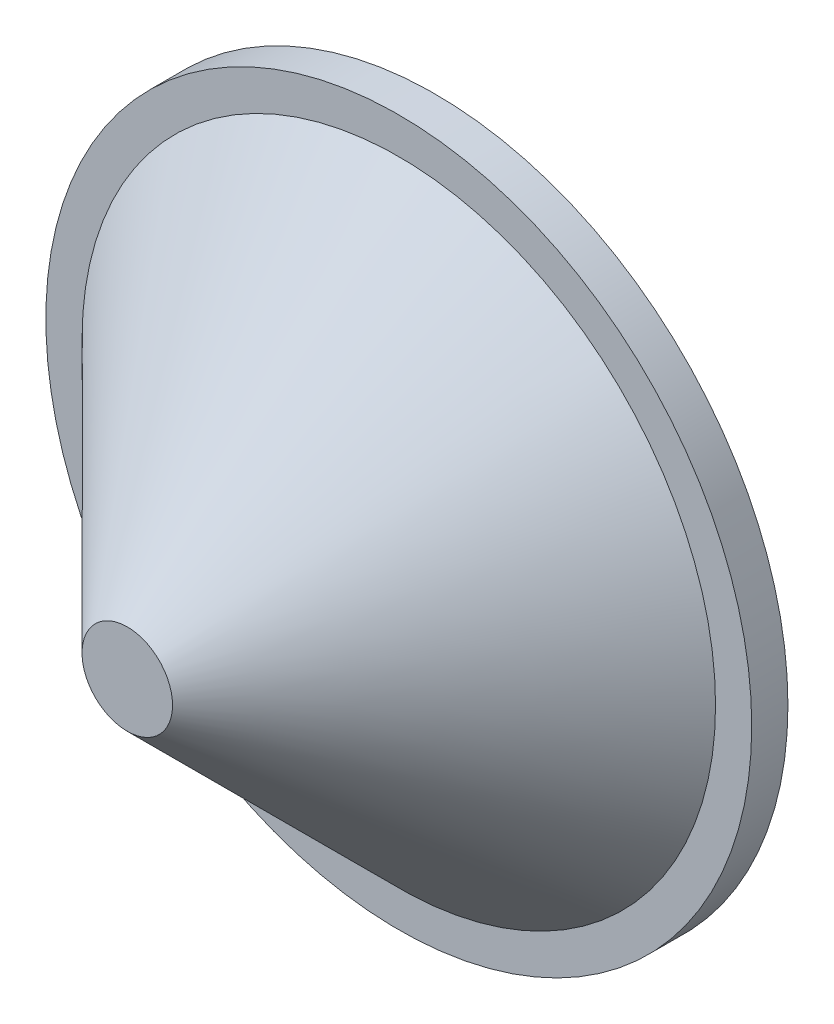
ISO-10303-21;
HEADER;
FILE_DESCRIPTION(('STEP AP214'),'2;1');
FILE_NAME('part.step','',(''),(''),'','','');
FILE_SCHEMA(('AUTOMOTIVE_DESIGN { 1 0 10303 214 1 1 1 1 }'));
ENDSEC;
DATA;
#1=APPLICATION_CONTEXT('core data for automotive mechanical design processes');
#2=APPLICATION_PROTOCOL_DEFINITION('international standard','automotive_design',2000,#1);
#3=PRODUCT_CONTEXT('',#1,'mechanical');
#4=PRODUCT('Part','Part','',(#3));
#5=PRODUCT_RELATED_PRODUCT_CATEGORY('part','',(#4));
#6=PRODUCT_DEFINITION_FORMATION('','',#4);
#7=PRODUCT_DEFINITION_CONTEXT('part definition',#1,'design');
#8=PRODUCT_DEFINITION('design','',#6,#7);
#9=PRODUCT_DEFINITION_SHAPE('','',#8);
#10=(LENGTH_UNIT() NAMED_UNIT(*) SI_UNIT(.MILLI.,.METRE.));
#11=(NAMED_UNIT(*) PLANE_ANGLE_UNIT() SI_UNIT($,.RADIAN.));
#12=(NAMED_UNIT(*) SI_UNIT($,.STERADIAN.) SOLID_ANGLE_UNIT());
#13=UNCERTAINTY_MEASURE_WITH_UNIT(LENGTH_MEASURE(1.E-05),#10,'distance_accuracy_value','');
#14=(GEOMETRIC_REPRESENTATION_CONTEXT(3) GLOBAL_UNCERTAINTY_ASSIGNED_CONTEXT((#13)) GLOBAL_UNIT_ASSIGNED_CONTEXT((#10,
#11,#12)) REPRESENTATION_CONTEXT('',''));
#15=CARTESIAN_POINT('',(0.,0.,0.));
#16=DIRECTION('',(0.,0.,1.));
#17=DIRECTION('',(1.,0.,0.));
#18=AXIS2_PLACEMENT_3D('',#15,#16,#17);
#19=CARTESIAN_POINT('',(0.,0.,0.));
#20=DIRECTION('',(0.,0.,1.));
#21=DIRECTION('',(1.,0.,0.));
#22=AXIS2_PLACEMENT_3D('',#19,#20,#21);
#23=PLANE('',#22);
#24=CARTESIAN_POINT('',(0.,0.,0.));
#25=DIRECTION('',(0.,0.,1.));
#26=DIRECTION('',(1.,0.,0.));
#27=AXIS2_PLACEMENT_3D('',#24,#25,#26);
#28=CIRCLE('',#27,38.9999999999995);
#29=CARTESIAN_POINT('',(38.9999999999996,0.,0.));
#30=VERTEX_POINT('',#29);
#31=EDGE_CURVE('E11',#30,#30,#28,.T.);
#32=ORIENTED_EDGE('',*,*,#31,.F.);
#33=EDGE_LOOP('',(#32));
#34=FACE_BOUND('',#33,.T.);
#35=DIRECTION('',(-0.707106781186548,0.707106781186547,0.));
#36=VECTOR('',#35,1.);
#37=CARTESIAN_POINT('',(-12.5,-15.5,0.));
#38=LINE('',#37,#36);
#39=CARTESIAN_POINT('',(-12.5,-15.5,0.));
#40=VERTEX_POINT('',#39);
#41=CARTESIAN_POINT('',(-15.5,-12.5,0.));
#42=VERTEX_POINT('',#41);
#43=EDGE_CURVE('E46',#40,#42,#38,.T.);
#44=ORIENTED_EDGE('',*,*,#43,.F.);
#45=DIRECTION('',(-1.,0.,0.));
#46=VECTOR('',#45,1.);
#47=CARTESIAN_POINT('',(-12.5,-15.5,0.));
#48=LINE('',#47,#46);
#49=CARTESIAN_POINT('',(12.5,-15.5,0.));
#50=VERTEX_POINT('',#49);
#51=EDGE_CURVE('E50',#50,#40,#48,.T.);
#52=ORIENTED_EDGE('',*,*,#51,.F.);
#53=DIRECTION('',(-0.707106781186548,-0.707106781186547,0.));
#54=VECTOR('',#53,1.);
#55=CARTESIAN_POINT('',(15.5,-12.5,0.));
#56=LINE('',#55,#54);
#57=CARTESIAN_POINT('',(15.5,-12.5,0.));
#58=VERTEX_POINT('',#57);
#59=EDGE_CURVE('E238',#58,#50,#56,.T.);
#60=ORIENTED_EDGE('',*,*,#59,.F.);
#61=DIRECTION('',(0.,-1.,0.));
#62=VECTOR('',#61,1.);
#63=CARTESIAN_POINT('',(15.5,-12.5,0.));
#64=LINE('',#63,#62);
#65=CARTESIAN_POINT('',(15.5,12.5,0.));
#66=VERTEX_POINT('',#65);
#67=EDGE_CURVE('E272',#66,#58,#64,.T.);
#68=ORIENTED_EDGE('',*,*,#67,.F.);
#69=DIRECTION('',(0.707106781186548,-0.707106781186547,0.));
#70=VECTOR('',#69,1.);
#71=CARTESIAN_POINT('',(12.5,15.5,0.));
#72=LINE('',#71,#70);
#73=CARTESIAN_POINT('',(12.5,15.5,0.));
#74=VERTEX_POINT('',#73);
#75=EDGE_CURVE('E265',#74,#66,#72,.T.);
#76=ORIENTED_EDGE('',*,*,#75,.F.);
#77=DIRECTION('',(1.,0.,0.));
#78=VECTOR('',#77,1.);
#79=CARTESIAN_POINT('',(12.5,15.5,0.));
#80=LINE('',#79,#78);
#81=CARTESIAN_POINT('',(-12.5,15.5,0.));
#82=VERTEX_POINT('',#81);
#83=EDGE_CURVE('E259',#82,#74,#80,.T.);
#84=ORIENTED_EDGE('',*,*,#83,.F.);
#85=DIRECTION('',(0.707106781186548,0.707106781186547,0.));
#86=VECTOR('',#85,1.);
#87=CARTESIAN_POINT('',(-15.5,12.5,0.));
#88=LINE('',#87,#86);
#89=CARTESIAN_POINT('',(-15.5,12.5,0.));
#90=VERTEX_POINT('',#89);
#91=EDGE_CURVE('E262',#90,#82,#88,.T.);
#92=ORIENTED_EDGE('',*,*,#91,.F.);
#93=DIRECTION('',(0.,1.,0.));
#94=VECTOR('',#93,1.);
#95=CARTESIAN_POINT('',(-15.5,12.5,0.));
#96=LINE('',#95,#94);
#97=EDGE_CURVE('E263',#42,#90,#96,.T.);
#98=ORIENTED_EDGE('',*,*,#97,.F.);
#99=EDGE_LOOP('',(#44,#52,#60,#68,#76,#84,#92,#98));
#100=FACE_BOUND('',#99,.T.);
#101=ADVANCED_FACE('F32',(#34,#100),#23,.F.);
#102=CARTESIAN_POINT('',(1.66533453693773E-13,-2.22044604925031E-13,926.802095792933));
#103=DIRECTION('',(0.,0.,1.));
#104=DIRECTION('',(1.,0.,0.));
#105=AXIS2_PLACEMENT_3D('',#102,#103,#104);
#106=CYLINDRICAL_SURFACE('',#105,38.9999999999995);
#107=CARTESIAN_POINT('',(-2.77555756156289E-13,0.,4.));
#108=DIRECTION('',(0.,0.,1.));
#109=DIRECTION('',(1.,0.,0.));
#110=AXIS2_PLACEMENT_3D('',#107,#108,#109);
#111=CIRCLE('',#110,38.9999999999995);
#112=CARTESIAN_POINT('',(38.9999999999993,0.,4.00000000000001));
#113=VERTEX_POINT('',#112);
#114=EDGE_CURVE('E39',#113,#113,#111,.T.);
#115=ORIENTED_EDGE('',*,*,#114,.F.);
#116=EDGE_LOOP('',(#115));
#117=FACE_BOUND('',#116,.T.);
#118=ORIENTED_EDGE('',*,*,#31,.T.);
#119=EDGE_LOOP('',(#118));
#120=FACE_BOUND('',#119,.T.);
#121=ADVANCED_FACE('F131',(#117,#120),#106,.T.);
#122=CARTESIAN_POINT('',(-4.44089209850063E-13,38.9999999999995,4.));
#123=DIRECTION('',(0.,0.,-1.));
#124=DIRECTION('',(-1.,0.,0.));
#125=AXIS2_PLACEMENT_3D('',#122,#123,#124);
#126=PLANE('',#125);
#127=CARTESIAN_POINT('',(-2.77555756156289E-13,0.,4.));
#128=DIRECTION('',(0.,0.,1.));
#129=DIRECTION('',(1.,0.,0.));
#130=AXIS2_PLACEMENT_3D('',#127,#128,#129);
#131=CIRCLE('',#130,34.9999999999997);
#132=CARTESIAN_POINT('',(34.9999999999994,0.,4.00000000000001));
#133=VERTEX_POINT('',#132);
#134=EDGE_CURVE('E119',#133,#133,#131,.T.);
#135=ORIENTED_EDGE('',*,*,#134,.F.);
#136=EDGE_LOOP('',(#135));
#137=FACE_BOUND('',#136,.T.);
#138=ORIENTED_EDGE('',*,*,#114,.T.);
#139=EDGE_LOOP('',(#138));
#140=FACE_BOUND('',#139,.T.);
#141=ADVANCED_FACE('F129',(#137,#140),#126,.F.);
#142=CARTESIAN_POINT('',(-2.77555756156289E-13,0.,4.));
#143=DIRECTION('',(0.,0.,-1.));
#144=DIRECTION('',(-1.,0.,0.));
#145=AXIS2_PLACEMENT_3D('',#142,#143,#144);
#146=CONICAL_SURFACE('',#145,34.9999999999997,0.785398163397443);
#147=CARTESIAN_POINT('',(-1.11022302462516E-13,-1.11022302462516E-13,34.));
#148=DIRECTION('',(0.,0.,1.));
#149=DIRECTION('',(1.,0.,0.));
#150=AXIS2_PLACEMENT_3D('',#147,#148,#149);
#151=CIRCLE('',#150,5.);
#152=CARTESIAN_POINT('',(4.99999999999989,-1.11115206087321E-13,34.));
#153=VERTEX_POINT('',#152);
#154=EDGE_CURVE('E116',#153,#153,#151,.T.);
#155=ORIENTED_EDGE('',*,*,#154,.F.);
#156=EDGE_LOOP('',(#155));
#157=FACE_BOUND('',#156,.T.);
#158=ORIENTED_EDGE('',*,*,#134,.T.);
#159=EDGE_LOOP('',(#158));
#160=FACE_BOUND('',#159,.T.);
#161=ADVANCED_FACE('F151',(#157,#160),#146,.T.);
#162=CARTESIAN_POINT('',(-1.11022302462516E-13,4.99999999999989,34.));
#163=DIRECTION('',(0.,0.,-1.));
#164=DIRECTION('',(-1.,0.,0.));
#165=AXIS2_PLACEMENT_3D('',#162,#163,#164);
#166=PLANE('',#165);
#167=ORIENTED_EDGE('',*,*,#154,.T.);
#168=EDGE_LOOP('',(#167));
#169=FACE_BOUND('',#168,.T.);
#170=ADVANCED_FACE('F159',(#169),#166,.F.);
#171=CARTESIAN_POINT('',(-12.5000000000002,-15.5000000000002,-5.));
#172=DIRECTION('',(0.707106781186548,0.707106781186548,0.));
#173=DIRECTION('',(-0.707106781186548,0.707106781186547,0.));
#174=AXIS2_PLACEMENT_3D('',#171,#172,#173);
#175=PLANE('',#174);
#176=ORIENTED_EDGE('',*,*,#43,.T.);
#177=DIRECTION('',(0.,0.,1.));
#178=VECTOR('',#177,1.);
#179=CARTESIAN_POINT('',(-15.5000000000002,-12.5000000000002,-4.99999999999992));
#180=LINE('',#179,#178);
#181=CARTESIAN_POINT('',(-15.5000000000002,-12.5000000000002,-4.99999999999992));
#182=VERTEX_POINT('',#181);
#183=EDGE_CURVE('E99',#182,#42,#180,.T.);
#184=ORIENTED_EDGE('',*,*,#183,.F.);
#185=DIRECTION('',(-0.707106781186548,0.707106781186547,0.));
#186=VECTOR('',#185,1.);
#187=CARTESIAN_POINT('',(-12.5000000000002,-15.5000000000002,-5.));
#188=LINE('',#187,#186);
#189=CARTESIAN_POINT('',(-12.5000000000002,-15.5000000000002,-5.));
#190=VERTEX_POINT('',#189);
#191=EDGE_CURVE('E105',#190,#182,#188,.T.);
#192=ORIENTED_EDGE('',*,*,#191,.F.);
#193=DIRECTION('',(0.,0.,1.));
#194=VECTOR('',#193,1.);
#195=CARTESIAN_POINT('',(-12.5000000000002,-15.5000000000002,-5.));
#196=LINE('',#195,#194);
#197=EDGE_CURVE('E235',#190,#40,#196,.T.);
#198=ORIENTED_EDGE('',*,*,#197,.T.);
#199=EDGE_LOOP('',(#176,#184,#192,#198));
#200=FACE_BOUND('',#199,.T.);
#201=ADVANCED_FACE('F115',(#200),#175,.F.);
#202=CARTESIAN_POINT('',(-15.5000000000001,12.4999999999998,-4.99999999999992));
#203=DIRECTION('',(1.,0.,0.));
#204=DIRECTION('',(0.,0.,-1.));
#205=AXIS2_PLACEMENT_3D('',#202,#203,#204);
#206=PLANE('',#205);
#207=ORIENTED_EDGE('',*,*,#97,.T.);
#208=DIRECTION('',(0.,0.,1.));
#209=VECTOR('',#208,1.);
#210=CARTESIAN_POINT('',(-15.5000000000001,12.4999999999998,-4.99999999999992));
#211=LINE('',#210,#209);
#212=CARTESIAN_POINT('',(-15.5000000000001,12.4999999999998,-4.99999999999992));
#213=VERTEX_POINT('',#212);
#214=EDGE_CURVE('E101',#213,#90,#211,.T.);
#215=ORIENTED_EDGE('',*,*,#214,.F.);
#216=DIRECTION('',(0.,1.,0.));
#217=VECTOR('',#216,1.);
#218=CARTESIAN_POINT('',(-15.5000000000001,12.4999999999998,-4.99999999999992));
#219=LINE('',#218,#217);
#220=EDGE_CURVE('E94',#182,#213,#219,.T.);
#221=ORIENTED_EDGE('',*,*,#220,.F.);
#222=ORIENTED_EDGE('',*,*,#183,.T.);
#223=EDGE_LOOP('',(#207,#215,#221,#222));
#224=FACE_BOUND('',#223,.T.);
#225=ADVANCED_FACE('F97',(#224),#206,.F.);
#226=CARTESIAN_POINT('',(-15.5000000000001,12.4999999999998,-4.99999999999992));
#227=DIRECTION('',(0.707106781186548,-0.707106781186548,0.));
#228=DIRECTION('',(0.707106781186548,0.707106781186547,0.));
#229=AXIS2_PLACEMENT_3D('',#226,#227,#228);
#230=PLANE('',#229);
#231=ORIENTED_EDGE('',*,*,#91,.T.);
#232=DIRECTION('',(0.,0.,1.));
#233=VECTOR('',#232,1.);
#234=CARTESIAN_POINT('',(-12.5000000000001,15.4999999999998,-5.));
#235=LINE('',#234,#233);
#236=CARTESIAN_POINT('',(-12.5000000000001,15.4999999999998,-5.));
#237=VERTEX_POINT('',#236);
#238=EDGE_CURVE('E121',#237,#82,#235,.T.);
#239=ORIENTED_EDGE('',*,*,#238,.F.);
#240=DIRECTION('',(0.707106781186548,0.707106781186547,0.));
#241=VECTOR('',#240,1.);
#242=CARTESIAN_POINT('',(-15.5000000000001,12.4999999999998,-4.99999999999992));
#243=LINE('',#242,#241);
#244=EDGE_CURVE('E104',#213,#237,#243,.T.);
#245=ORIENTED_EDGE('',*,*,#244,.F.);
#246=ORIENTED_EDGE('',*,*,#214,.T.);
#247=EDGE_LOOP('',(#231,#239,#245,#246));
#248=FACE_BOUND('',#247,.T.);
#249=ADVANCED_FACE('F178',(#248),#230,.F.);
#250=CARTESIAN_POINT('',(12.5,15.5,-4.99999999999995));
#251=DIRECTION('',(0.,-1.,0.));
#252=DIRECTION('',(0.,0.,-1.));
#253=AXIS2_PLACEMENT_3D('',#250,#251,#252);
#254=PLANE('',#253);
#255=ORIENTED_EDGE('',*,*,#83,.T.);
#256=DIRECTION('',(0.,0.,1.));
#257=VECTOR('',#256,1.);
#258=CARTESIAN_POINT('',(12.5,15.5,-4.99999999999995));
#259=LINE('',#258,#257);
#260=CARTESIAN_POINT('',(12.5,15.5,-4.99999999999995));
#261=VERTEX_POINT('',#260);
#262=EDGE_CURVE('E252',#261,#74,#259,.T.);
#263=ORIENTED_EDGE('',*,*,#262,.F.);
#264=DIRECTION('',(1.,0.,0.));
#265=VECTOR('',#264,1.);
#266=CARTESIAN_POINT('',(12.5,15.5,-4.99999999999995));
#267=LINE('',#266,#265);
#268=EDGE_CURVE('E260',#237,#261,#267,.T.);
#269=ORIENTED_EDGE('',*,*,#268,.F.);
#270=ORIENTED_EDGE('',*,*,#238,.T.);
#271=EDGE_LOOP('',(#255,#263,#269,#270));
#272=FACE_BOUND('',#271,.T.);
#273=ADVANCED_FACE('F185',(#272),#254,.F.);
#274=CARTESIAN_POINT('',(12.5,15.5,-4.99999999999995));
#275=DIRECTION('',(-0.707106781186548,-0.707106781186548,0.));
#276=DIRECTION('',(0.707106781186548,-0.707106781186547,0.));
#277=AXIS2_PLACEMENT_3D('',#274,#275,#276);
#278=PLANE('',#277);
#279=ORIENTED_EDGE('',*,*,#75,.T.);
#280=DIRECTION('',(0.,0.,1.));
#281=VECTOR('',#280,1.);
#282=CARTESIAN_POINT('',(15.5,12.5,-5.));
#283=LINE('',#282,#281);
#284=CARTESIAN_POINT('',(15.5,12.5,-5.));
#285=VERTEX_POINT('',#284);
#286=EDGE_CURVE('E249',#285,#66,#283,.T.);
#287=ORIENTED_EDGE('',*,*,#286,.F.);
#288=DIRECTION('',(0.707106781186548,-0.707106781186547,0.));
#289=VECTOR('',#288,1.);
#290=CARTESIAN_POINT('',(12.5,15.5,-4.99999999999995));
#291=LINE('',#290,#289);
#292=EDGE_CURVE('E280',#261,#285,#291,.T.);
#293=ORIENTED_EDGE('',*,*,#292,.F.);
#294=ORIENTED_EDGE('',*,*,#262,.T.);
#295=EDGE_LOOP('',(#279,#287,#293,#294));
#296=FACE_BOUND('',#295,.T.);
#297=ADVANCED_FACE('F193',(#296),#278,.F.);
#298=CARTESIAN_POINT('',(15.5,-12.5,-5.));
#299=DIRECTION('',(-1.,0.,0.));
#300=DIRECTION('',(0.,0.,1.));
#301=AXIS2_PLACEMENT_3D('',#298,#299,#300);
#302=PLANE('',#301);
#303=ORIENTED_EDGE('',*,*,#67,.T.);
#304=DIRECTION('',(0.,0.,1.));
#305=VECTOR('',#304,1.);
#306=CARTESIAN_POINT('',(15.5,-12.5,-5.));
#307=LINE('',#306,#305);
#308=CARTESIAN_POINT('',(15.5,-12.5,-5.));
#309=VERTEX_POINT('',#308);
#310=EDGE_CURVE('E241',#309,#58,#307,.T.);
#311=ORIENTED_EDGE('',*,*,#310,.F.);
#312=DIRECTION('',(0.,-1.,0.));
#313=VECTOR('',#312,1.);
#314=CARTESIAN_POINT('',(15.5,-12.5,-5.));
#315=LINE('',#314,#313);
#316=EDGE_CURVE('E278',#285,#309,#315,.T.);
#317=ORIENTED_EDGE('',*,*,#316,.F.);
#318=ORIENTED_EDGE('',*,*,#286,.T.);
#319=EDGE_LOOP('',(#303,#311,#317,#318));
#320=FACE_BOUND('',#319,.T.);
#321=ADVANCED_FACE('F201',(#320),#302,.F.);
#322=CARTESIAN_POINT('',(15.5,-12.5,-5.));
#323=DIRECTION('',(-0.707106781186548,0.707106781186548,0.));
#324=DIRECTION('',(-0.707106781186548,-0.707106781186547,0.));
#325=AXIS2_PLACEMENT_3D('',#322,#323,#324);
#326=PLANE('',#325);
#327=ORIENTED_EDGE('',*,*,#59,.T.);
#328=DIRECTION('',(0.,0.,1.));
#329=VECTOR('',#328,1.);
#330=CARTESIAN_POINT('',(12.5,-15.5,-4.99999999999995));
#331=LINE('',#330,#329);
#332=CARTESIAN_POINT('',(12.5,-15.5,-4.99999999999995));
#333=VERTEX_POINT('',#332);
#334=EDGE_CURVE('E237',#333,#50,#331,.T.);
#335=ORIENTED_EDGE('',*,*,#334,.F.);
#336=DIRECTION('',(-0.707106781186548,-0.707106781186547,0.));
#337=VECTOR('',#336,1.);
#338=CARTESIAN_POINT('',(15.5,-12.5,-5.));
#339=LINE('',#338,#337);
#340=EDGE_CURVE('E243',#309,#333,#339,.T.);
#341=ORIENTED_EDGE('',*,*,#340,.F.);
#342=ORIENTED_EDGE('',*,*,#310,.T.);
#343=EDGE_LOOP('',(#327,#335,#341,#342));
#344=FACE_BOUND('',#343,.T.);
#345=ADVANCED_FACE('F209',(#344),#326,.F.);
#346=CARTESIAN_POINT('',(-12.5000000000002,-15.5000000000002,-5.));
#347=DIRECTION('',(0.,1.,0.));
#348=DIRECTION('',(0.,0.,1.));
#349=AXIS2_PLACEMENT_3D('',#346,#347,#348);
#350=PLANE('',#349);
#351=ORIENTED_EDGE('',*,*,#51,.T.);
#352=ORIENTED_EDGE('',*,*,#197,.F.);
#353=DIRECTION('',(-1.,0.,0.));
#354=VECTOR('',#353,1.);
#355=CARTESIAN_POINT('',(-12.5000000000002,-15.5000000000002,-5.));
#356=LINE('',#355,#354);
#357=EDGE_CURVE('E110',#333,#190,#356,.T.);
#358=ORIENTED_EDGE('',*,*,#357,.F.);
#359=ORIENTED_EDGE('',*,*,#334,.T.);
#360=EDGE_LOOP('',(#351,#352,#358,#359));
#361=FACE_BOUND('',#360,.T.);
#362=ADVANCED_FACE('F217',(#361),#350,.F.);
#363=CARTESIAN_POINT('',(0.,0.,-5.));
#364=DIRECTION('',(0.,0.,-1.));
#365=DIRECTION('',(-1.,0.,0.));
#366=AXIS2_PLACEMENT_3D('',#363,#364,#365);
#367=PLANE('',#366);
#368=ORIENTED_EDGE('',*,*,#191,.T.);
#369=ORIENTED_EDGE('',*,*,#220,.T.);
#370=ORIENTED_EDGE('',*,*,#244,.T.);
#371=ORIENTED_EDGE('',*,*,#268,.T.);
#372=ORIENTED_EDGE('',*,*,#292,.T.);
#373=ORIENTED_EDGE('',*,*,#316,.T.);
#374=ORIENTED_EDGE('',*,*,#340,.T.);
#375=ORIENTED_EDGE('',*,*,#357,.T.);
#376=EDGE_LOOP('',(#368,#369,#370,#371,#372,#373,#374,#375));
#377=FACE_BOUND('',#376,.T.);
#378=ADVANCED_FACE('F108',(#377),#367,.T.);
#379=CLOSED_SHELL('',(#101,#121,#141,#161,#170,#201,#225,#249,#273,#297,#321,#345,#362,#378));
#380=MANIFOLD_SOLID_BREP('B2',#379);
#381=ADVANCED_BREP_SHAPE_REPRESENTATION('',(#18,#380),#14);
#382=SHAPE_DEFINITION_REPRESENTATION(#9,#381);
ENDSEC;
END-ISO-10303-21;
